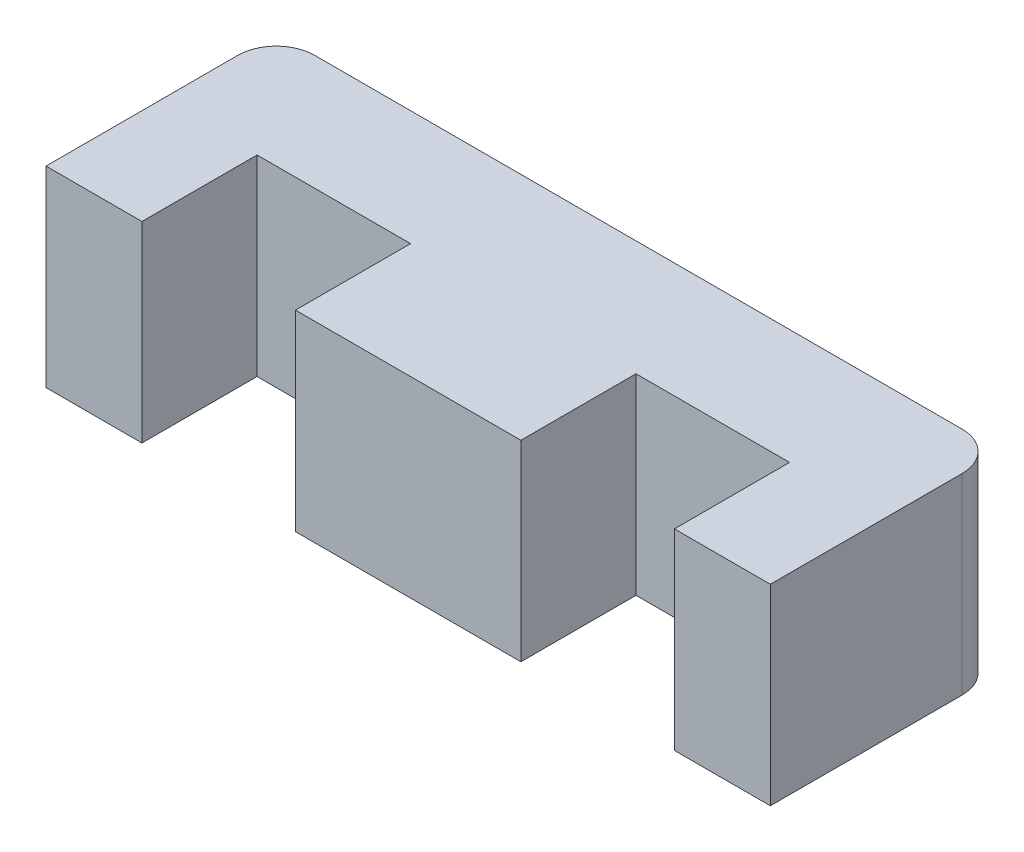
ISO-10303-21;
HEADER;
FILE_DESCRIPTION(('STEP AP214'),'2;1');
FILE_NAME('part.step','',(''),(''),'','','');
FILE_SCHEMA(('AUTOMOTIVE_DESIGN { 1 0 10303 214 1 1 1 1 }'));
ENDSEC;
DATA;
#1=APPLICATION_CONTEXT('core data for automotive mechanical design processes');
#2=APPLICATION_PROTOCOL_DEFINITION('international standard','automotive_design',2000,#1);
#3=PRODUCT_CONTEXT('',#1,'mechanical');
#4=PRODUCT('Part','Part','',(#3));
#5=PRODUCT_RELATED_PRODUCT_CATEGORY('part','',(#4));
#6=PRODUCT_DEFINITION_FORMATION('','',#4);
#7=PRODUCT_DEFINITION_CONTEXT('part definition',#1,'design');
#8=PRODUCT_DEFINITION('design','',#6,#7);
#9=PRODUCT_DEFINITION_SHAPE('','',#8);
#10=(LENGTH_UNIT() NAMED_UNIT(*) SI_UNIT(.MILLI.,.METRE.));
#11=(NAMED_UNIT(*) PLANE_ANGLE_UNIT() SI_UNIT($,.RADIAN.));
#12=(NAMED_UNIT(*) SI_UNIT($,.STERADIAN.) SOLID_ANGLE_UNIT());
#13=UNCERTAINTY_MEASURE_WITH_UNIT(LENGTH_MEASURE(1.E-05),#10,'distance_accuracy_value','');
#14=(GEOMETRIC_REPRESENTATION_CONTEXT(3) GLOBAL_UNCERTAINTY_ASSIGNED_CONTEXT((#13)) GLOBAL_UNIT_ASSIGNED_CONTEXT((#10,
#11,#12)) REPRESENTATION_CONTEXT('',''));
#15=CARTESIAN_POINT('',(0.,0.,0.));
#16=DIRECTION('',(0.,0.,1.));
#17=DIRECTION('',(1.,0.,0.));
#18=AXIS2_PLACEMENT_3D('',#15,#16,#17);
#19=CARTESIAN_POINT('',(0.,10.,6.));
#20=DIRECTION('',(-1.,0.,0.));
#21=DIRECTION('',(0.,0.,1.));
#22=AXIS2_PLACEMENT_3D('',#19,#20,#21);
#23=PLANE('',#22);
#24=DIRECTION('',(0.,0.,-1.));
#25=VECTOR('',#24,1.);
#26=CARTESIAN_POINT('',(0.,0.,6.));
#27=LINE('',#26,#25);
#28=CARTESIAN_POINT('',(0.,0.,6.));
#29=VERTEX_POINT('',#28);
#30=CARTESIAN_POINT('',(0.,0.,0.));
#31=VERTEX_POINT('',#30);
#32=EDGE_CURVE('E167',#29,#31,#27,.T.);
#33=ORIENTED_EDGE('',*,*,#32,.T.);
#34=DIRECTION('',(0.,-1.,0.));
#35=VECTOR('',#34,1.);
#36=CARTESIAN_POINT('',(0.,10.,0.));
#37=LINE('',#36,#35);
#38=CARTESIAN_POINT('',(0.,10.,0.));
#39=VERTEX_POINT('',#38);
#40=EDGE_CURVE('E147',#39,#31,#37,.T.);
#41=ORIENTED_EDGE('',*,*,#40,.F.);
#42=DIRECTION('',(0.,0.,-1.));
#43=VECTOR('',#42,1.);
#44=CARTESIAN_POINT('',(0.,10.,6.));
#45=LINE('',#44,#43);
#46=CARTESIAN_POINT('',(0.,10.,6.));
#47=VERTEX_POINT('',#46);
#48=EDGE_CURVE('E154',#47,#39,#45,.T.);
#49=ORIENTED_EDGE('',*,*,#48,.F.);
#50=DIRECTION('',(0.,-1.,0.));
#51=VECTOR('',#50,1.);
#52=CARTESIAN_POINT('',(0.,10.,6.));
#53=LINE('',#52,#51);
#54=EDGE_CURVE('E232',#47,#29,#53,.T.);
#55=ORIENTED_EDGE('',*,*,#54,.T.);
#56=EDGE_LOOP('',(#33,#41,#49,#55));
#57=FACE_BOUND('',#56,.T.);
#58=ADVANCED_FACE('F38',(#57),#23,.F.);
#59=CARTESIAN_POINT('',(0.,10.,0.));
#60=DIRECTION('',(0.,0.,-1.));
#61=DIRECTION('',(-1.,0.,0.));
#62=AXIS2_PLACEMENT_3D('',#59,#60,#61);
#63=PLANE('',#62);
#64=DIRECTION('',(1.,0.,0.));
#65=VECTOR('',#64,1.);
#66=CARTESIAN_POINT('',(0.,0.,0.));
#67=LINE('',#66,#65);
#68=CARTESIAN_POINT('',(8.,0.,0.));
#69=VERTEX_POINT('',#68);
#70=EDGE_CURVE('E278',#31,#69,#67,.T.);
#71=ORIENTED_EDGE('',*,*,#70,.T.);
#72=DIRECTION('',(0.,-1.,0.));
#73=VECTOR('',#72,1.);
#74=CARTESIAN_POINT('',(8.,10.,0.));
#75=LINE('',#74,#73);
#76=CARTESIAN_POINT('',(8.,10.,0.));
#77=VERTEX_POINT('',#76);
#78=EDGE_CURVE('E150',#77,#69,#75,.T.);
#79=ORIENTED_EDGE('',*,*,#78,.F.);
#80=DIRECTION('',(1.,0.,0.));
#81=VECTOR('',#80,1.);
#82=CARTESIAN_POINT('',(0.,10.,0.));
#83=LINE('',#82,#81);
#84=EDGE_CURVE('E143',#39,#77,#83,.T.);
#85=ORIENTED_EDGE('',*,*,#84,.F.);
#86=ORIENTED_EDGE('',*,*,#40,.T.);
#87=EDGE_LOOP('',(#71,#79,#85,#86));
#88=FACE_BOUND('',#87,.T.);
#89=ADVANCED_FACE('F145',(#88),#63,.F.);
#90=CARTESIAN_POINT('',(8.,10.,0.));
#91=DIRECTION('',(1.,0.,0.));
#92=DIRECTION('',(0.,0.,-1.));
#93=AXIS2_PLACEMENT_3D('',#90,#91,#92);
#94=PLANE('',#93);
#95=DIRECTION('',(0.,0.,1.));
#96=VECTOR('',#95,1.);
#97=CARTESIAN_POINT('',(8.,0.,0.));
#98=LINE('',#97,#96);
#99=CARTESIAN_POINT('',(8.,0.,6.));
#100=VERTEX_POINT('',#99);
#101=EDGE_CURVE('E269',#69,#100,#98,.T.);
#102=ORIENTED_EDGE('',*,*,#101,.T.);
#103=DIRECTION('',(0.,-1.,0.));
#104=VECTOR('',#103,1.);
#105=CARTESIAN_POINT('',(8.,10.,6.));
#106=LINE('',#105,#104);
#107=CARTESIAN_POINT('',(8.,10.,6.));
#108=VERTEX_POINT('',#107);
#109=EDGE_CURVE('E175',#108,#100,#106,.T.);
#110=ORIENTED_EDGE('',*,*,#109,.F.);
#111=DIRECTION('',(0.,0.,1.));
#112=VECTOR('',#111,1.);
#113=CARTESIAN_POINT('',(8.,10.,0.));
#114=LINE('',#113,#112);
#115=EDGE_CURVE('E153',#77,#108,#114,.T.);
#116=ORIENTED_EDGE('',*,*,#115,.F.);
#117=ORIENTED_EDGE('',*,*,#78,.T.);
#118=EDGE_LOOP('',(#102,#110,#116,#117));
#119=FACE_BOUND('',#118,.T.);
#120=ADVANCED_FACE('F310',(#119),#94,.F.);
#121=CARTESIAN_POINT('',(8.,10.,6.));
#122=DIRECTION('',(0.,0.,-1.));
#123=DIRECTION('',(-1.,0.,0.));
#124=AXIS2_PLACEMENT_3D('',#121,#122,#123);
#125=PLANE('',#124);
#126=DIRECTION('',(1.,0.,0.));
#127=VECTOR('',#126,1.);
#128=CARTESIAN_POINT('',(8.,0.,6.));
#129=LINE('',#128,#127);
#130=CARTESIAN_POINT('',(19.75,0.,6.));
#131=VERTEX_POINT('',#130);
#132=EDGE_CURVE('E264',#100,#131,#129,.T.);
#133=ORIENTED_EDGE('',*,*,#132,.T.);
#134=DIRECTION('',(0.,-1.,0.));
#135=VECTOR('',#134,1.);
#136=CARTESIAN_POINT('',(19.75,10.,6.));
#137=LINE('',#136,#135);
#138=CARTESIAN_POINT('',(19.75,10.,6.));
#139=VERTEX_POINT('',#138);
#140=EDGE_CURVE('E253',#139,#131,#137,.T.);
#141=ORIENTED_EDGE('',*,*,#140,.F.);
#142=DIRECTION('',(1.,0.,0.));
#143=VECTOR('',#142,1.);
#144=CARTESIAN_POINT('',(8.,10.,6.));
#145=LINE('',#144,#143);
#146=EDGE_CURVE('E265',#108,#139,#145,.T.);
#147=ORIENTED_EDGE('',*,*,#146,.F.);
#148=ORIENTED_EDGE('',*,*,#109,.T.);
#149=EDGE_LOOP('',(#133,#141,#147,#148));
#150=FACE_BOUND('',#149,.T.);
#151=ADVANCED_FACE('F262',(#150),#125,.F.);
#152=CARTESIAN_POINT('',(19.75,10.,6.));
#153=DIRECTION('',(-1.,0.,0.));
#154=DIRECTION('',(0.,0.,1.));
#155=AXIS2_PLACEMENT_3D('',#152,#153,#154);
#156=PLANE('',#155);
#157=DIRECTION('',(0.,0.,-1.));
#158=VECTOR('',#157,1.);
#159=CARTESIAN_POINT('',(19.75,0.,6.));
#160=LINE('',#159,#158);
#161=CARTESIAN_POINT('',(19.75,0.,0.));
#162=VERTEX_POINT('',#161);
#163=EDGE_CURVE('E271',#131,#162,#160,.T.);
#164=ORIENTED_EDGE('',*,*,#163,.T.);
#165=DIRECTION('',(0.,-1.,0.));
#166=VECTOR('',#165,1.);
#167=CARTESIAN_POINT('',(19.75,10.,0.));
#168=LINE('',#167,#166);
#169=CARTESIAN_POINT('',(19.75,10.,0.));
#170=VERTEX_POINT('',#169);
#171=EDGE_CURVE('E249',#170,#162,#168,.T.);
#172=ORIENTED_EDGE('',*,*,#171,.F.);
#173=DIRECTION('',(0.,0.,-1.));
#174=VECTOR('',#173,1.);
#175=CARTESIAN_POINT('',(19.75,10.,6.));
#176=LINE('',#175,#174);
#177=EDGE_CURVE('E314',#139,#170,#176,.T.);
#178=ORIENTED_EDGE('',*,*,#177,.F.);
#179=ORIENTED_EDGE('',*,*,#140,.T.);
#180=EDGE_LOOP('',(#164,#172,#178,#179));
#181=FACE_BOUND('',#180,.T.);
#182=ADVANCED_FACE('F325',(#181),#156,.F.);
#183=CARTESIAN_POINT('',(19.75,10.,0.));
#184=DIRECTION('',(0.,0.,-1.));
#185=DIRECTION('',(-1.,0.,0.));
#186=AXIS2_PLACEMENT_3D('',#183,#184,#185);
#187=PLANE('',#186);
#188=DIRECTION('',(1.,0.,0.));
#189=VECTOR('',#188,1.);
#190=CARTESIAN_POINT('',(19.75,0.,0.));
#191=LINE('',#190,#189);
#192=CARTESIAN_POINT('',(27.75,0.,0.));
#193=VERTEX_POINT('',#192);
#194=EDGE_CURVE('E276',#162,#193,#191,.T.);
#195=ORIENTED_EDGE('',*,*,#194,.T.);
#196=DIRECTION('',(0.,-1.,0.));
#197=VECTOR('',#196,1.);
#198=CARTESIAN_POINT('',(27.75,10.,0.));
#199=LINE('',#198,#197);
#200=CARTESIAN_POINT('',(27.75,10.,0.));
#201=VERTEX_POINT('',#200);
#202=EDGE_CURVE('E245',#201,#193,#199,.T.);
#203=ORIENTED_EDGE('',*,*,#202,.F.);
#204=DIRECTION('',(1.,0.,0.));
#205=VECTOR('',#204,1.);
#206=CARTESIAN_POINT('',(19.75,10.,0.));
#207=LINE('',#206,#205);
#208=EDGE_CURVE('E300',#170,#201,#207,.T.);
#209=ORIENTED_EDGE('',*,*,#208,.F.);
#210=ORIENTED_EDGE('',*,*,#171,.T.);
#211=EDGE_LOOP('',(#195,#203,#209,#210));
#212=FACE_BOUND('',#211,.T.);
#213=ADVANCED_FACE('F323',(#212),#187,.F.);
#214=CARTESIAN_POINT('',(27.75,10.,0.));
#215=DIRECTION('',(1.,0.,0.));
#216=DIRECTION('',(0.,0.,-1.));
#217=AXIS2_PLACEMENT_3D('',#214,#215,#216);
#218=PLANE('',#217);
#219=DIRECTION('',(0.,0.,1.));
#220=VECTOR('',#219,1.);
#221=CARTESIAN_POINT('',(27.75,0.,0.));
#222=LINE('',#221,#220);
#223=CARTESIAN_POINT('',(27.75,0.,6.));
#224=VERTEX_POINT('',#223);
#225=EDGE_CURVE('E224',#193,#224,#222,.T.);
#226=ORIENTED_EDGE('',*,*,#225,.T.);
#227=DIRECTION('',(0.,-1.,0.));
#228=VECTOR('',#227,1.);
#229=CARTESIAN_POINT('',(27.75,10.,6.));
#230=LINE('',#229,#228);
#231=CARTESIAN_POINT('',(27.75,10.,6.));
#232=VERTEX_POINT('',#231);
#233=EDGE_CURVE('E241',#232,#224,#230,.T.);
#234=ORIENTED_EDGE('',*,*,#233,.F.);
#235=DIRECTION('',(0.,0.,1.));
#236=VECTOR('',#235,1.);
#237=CARTESIAN_POINT('',(27.75,10.,0.));
#238=LINE('',#237,#236);
#239=EDGE_CURVE('E295',#201,#232,#238,.T.);
#240=ORIENTED_EDGE('',*,*,#239,.F.);
#241=ORIENTED_EDGE('',*,*,#202,.T.);
#242=EDGE_LOOP('',(#226,#234,#240,#241));
#243=FACE_BOUND('',#242,.T.);
#244=ADVANCED_FACE('F287',(#243),#218,.F.);
#245=CARTESIAN_POINT('',(27.75,10.,6.));
#246=DIRECTION('',(0.,0.,-1.));
#247=DIRECTION('',(-1.,0.,0.));
#248=AXIS2_PLACEMENT_3D('',#245,#246,#247);
#249=PLANE('',#248);
#250=DIRECTION('',(1.,0.,0.));
#251=VECTOR('',#250,1.);
#252=CARTESIAN_POINT('',(27.75,0.,6.));
#253=LINE('',#252,#251);
#254=CARTESIAN_POINT('',(32.75,0.,6.));
#255=VERTEX_POINT('',#254);
#256=EDGE_CURVE('E218',#224,#255,#253,.T.);
#257=ORIENTED_EDGE('',*,*,#256,.T.);
#258=DIRECTION('',(0.,-1.,0.));
#259=VECTOR('',#258,1.);
#260=CARTESIAN_POINT('',(32.75,10.,6.));
#261=LINE('',#260,#259);
#262=CARTESIAN_POINT('',(32.75,10.,6.));
#263=VERTEX_POINT('',#262);
#264=EDGE_CURVE('E216',#263,#255,#261,.T.);
#265=ORIENTED_EDGE('',*,*,#264,.F.);
#266=DIRECTION('',(1.,0.,0.));
#267=VECTOR('',#266,1.);
#268=CARTESIAN_POINT('',(27.75,10.,6.));
#269=LINE('',#268,#267);
#270=EDGE_CURVE('E293',#232,#263,#269,.T.);
#271=ORIENTED_EDGE('',*,*,#270,.F.);
#272=ORIENTED_EDGE('',*,*,#233,.T.);
#273=EDGE_LOOP('',(#257,#265,#271,#272));
#274=FACE_BOUND('',#273,.T.);
#275=ADVANCED_FACE('F292',(#274),#249,.F.);
#276=CARTESIAN_POINT('',(32.75,10.,6.));
#277=DIRECTION('',(-1.,0.,0.));
#278=DIRECTION('',(0.,0.,1.));
#279=AXIS2_PLACEMENT_3D('',#276,#277,#278);
#280=PLANE('',#279);
#281=DIRECTION('',(0.,0.,-1.));
#282=VECTOR('',#281,1.);
#283=CARTESIAN_POINT('',(32.75,0.,6.));
#284=LINE('',#283,#282);
#285=CARTESIAN_POINT('',(32.75,0.,-4.));
#286=VERTEX_POINT('',#285);
#287=EDGE_CURVE('E211',#255,#286,#284,.T.);
#288=ORIENTED_EDGE('',*,*,#287,.T.);
#289=DIRECTION('',(0.,-1.,0.));
#290=VECTOR('',#289,1.);
#291=CARTESIAN_POINT('',(32.75,10.,-4.));
#292=LINE('',#291,#290);
#293=CARTESIAN_POINT('',(32.75,10.,-4.));
#294=VERTEX_POINT('',#293);
#295=EDGE_CURVE('E62',#286,#294,#292,.F.);
#296=ORIENTED_EDGE('',*,*,#295,.T.);
#297=DIRECTION('',(0.,0.,-1.));
#298=VECTOR('',#297,1.);
#299=CARTESIAN_POINT('',(32.75,10.,6.));
#300=LINE('',#299,#298);
#301=EDGE_CURVE('E195',#263,#294,#300,.T.);
#302=ORIENTED_EDGE('',*,*,#301,.F.);
#303=ORIENTED_EDGE('',*,*,#264,.T.);
#304=EDGE_LOOP('',(#288,#296,#302,#303));
#305=FACE_BOUND('',#304,.T.);
#306=ADVANCED_FACE('F214',(#305),#280,.F.);
#307=CARTESIAN_POINT('',(32.75,10.,-6.));
#308=DIRECTION('',(0.,0.,1.));
#309=DIRECTION('',(1.,0.,0.));
#310=AXIS2_PLACEMENT_3D('',#307,#308,#309);
#311=PLANE('',#310);
#312=DIRECTION('',(-1.,0.,0.));
#313=VECTOR('',#312,1.);
#314=CARTESIAN_POINT('',(32.75,10.,-6.));
#315=LINE('',#314,#313);
#316=CARTESIAN_POINT('',(30.75,10.,-6.));
#317=VERTEX_POINT('',#316);
#318=CARTESIAN_POINT('',(-3.,10.,-6.));
#319=VERTEX_POINT('',#318);
#320=EDGE_CURVE('E194',#317,#319,#315,.T.);
#321=ORIENTED_EDGE('',*,*,#320,.F.);
#322=DIRECTION('',(0.,-1.,0.));
#323=VECTOR('',#322,1.);
#324=CARTESIAN_POINT('',(30.75,10.,-6.));
#325=LINE('',#324,#323);
#326=CARTESIAN_POINT('',(30.75,0.,-6.));
#327=VERTEX_POINT('',#326);
#328=EDGE_CURVE('E173',#317,#327,#325,.T.);
#329=ORIENTED_EDGE('',*,*,#328,.T.);
#330=DIRECTION('',(-1.,0.,0.));
#331=VECTOR('',#330,1.);
#332=CARTESIAN_POINT('',(32.75,0.,-6.));
#333=LINE('',#332,#331);
#334=CARTESIAN_POINT('',(-3.,0.,-6.));
#335=VERTEX_POINT('',#334);
#336=EDGE_CURVE('E212',#327,#335,#333,.T.);
#337=ORIENTED_EDGE('',*,*,#336,.T.);
#338=DIRECTION('',(0.,-1.,0.));
#339=VECTOR('',#338,1.);
#340=CARTESIAN_POINT('',(-3.,10.,-6.));
#341=LINE('',#340,#339);
#342=EDGE_CURVE('E169',#335,#319,#341,.F.);
#343=ORIENTED_EDGE('',*,*,#342,.T.);
#344=EDGE_LOOP('',(#321,#329,#337,#343));
#345=FACE_BOUND('',#344,.T.);
#346=ADVANCED_FACE('F199',(#345),#311,.F.);
#347=CARTESIAN_POINT('',(-5.,10.,-6.));
#348=DIRECTION('',(1.,0.,0.));
#349=DIRECTION('',(0.,0.,-1.));
#350=AXIS2_PLACEMENT_3D('',#347,#348,#349);
#351=PLANE('',#350);
#352=DIRECTION('',(0.,0.,1.));
#353=VECTOR('',#352,1.);
#354=CARTESIAN_POINT('',(-5.,10.,-6.));
#355=LINE('',#354,#353);
#356=CARTESIAN_POINT('',(-5.,10.,-4.));
#357=VERTEX_POINT('',#356);
#358=CARTESIAN_POINT('',(-5.,10.,6.));
#359=VERTEX_POINT('',#358);
#360=EDGE_CURVE('E204',#357,#359,#355,.T.);
#361=ORIENTED_EDGE('',*,*,#360,.F.);
#362=DIRECTION('',(0.,-1.,0.));
#363=VECTOR('',#362,1.);
#364=CARTESIAN_POINT('',(-5.,10.,-4.));
#365=LINE('',#364,#363);
#366=CARTESIAN_POINT('',(-5.,0.,-4.));
#367=VERTEX_POINT('',#366);
#368=EDGE_CURVE('E11',#357,#367,#365,.T.);
#369=ORIENTED_EDGE('',*,*,#368,.T.);
#370=DIRECTION('',(0.,0.,1.));
#371=VECTOR('',#370,1.);
#372=CARTESIAN_POINT('',(-5.,0.,-6.));
#373=LINE('',#372,#371);
#374=CARTESIAN_POINT('',(-5.,0.,6.));
#375=VERTEX_POINT('',#374);
#376=EDGE_CURVE('E222',#367,#375,#373,.T.);
#377=ORIENTED_EDGE('',*,*,#376,.T.);
#378=DIRECTION('',(0.,-1.,0.));
#379=VECTOR('',#378,1.);
#380=CARTESIAN_POINT('',(-5.,10.,6.));
#381=LINE('',#380,#379);
#382=EDGE_CURVE('E235',#359,#375,#381,.T.);
#383=ORIENTED_EDGE('',*,*,#382,.F.);
#384=EDGE_LOOP('',(#361,#369,#377,#383));
#385=FACE_BOUND('',#384,.T.);
#386=ADVANCED_FACE('F356',(#385),#351,.F.);
#387=CARTESIAN_POINT('',(-5.,10.,6.));
#388=DIRECTION('',(0.,0.,-1.));
#389=DIRECTION('',(-1.,0.,0.));
#390=AXIS2_PLACEMENT_3D('',#387,#388,#389);
#391=PLANE('',#390);
#392=DIRECTION('',(1.,0.,0.));
#393=VECTOR('',#392,1.);
#394=CARTESIAN_POINT('',(-5.,0.,6.));
#395=LINE('',#394,#393);
#396=EDGE_CURVE('E164',#375,#29,#395,.T.);
#397=ORIENTED_EDGE('',*,*,#396,.T.);
#398=ORIENTED_EDGE('',*,*,#54,.F.);
#399=DIRECTION('',(1.,0.,0.));
#400=VECTOR('',#399,1.);
#401=CARTESIAN_POINT('',(-5.,10.,6.));
#402=LINE('',#401,#400);
#403=EDGE_CURVE('E159',#359,#47,#402,.T.);
#404=ORIENTED_EDGE('',*,*,#403,.F.);
#405=ORIENTED_EDGE('',*,*,#382,.T.);
#406=EDGE_LOOP('',(#397,#398,#404,#405));
#407=FACE_BOUND('',#406,.T.);
#408=ADVANCED_FACE('F351',(#407),#391,.F.);
#409=CARTESIAN_POINT('',(0.,10.,0.));
#410=DIRECTION('',(0.,-1.,0.));
#411=DIRECTION('',(0.,0.,-1.));
#412=AXIS2_PLACEMENT_3D('',#409,#410,#411);
#413=PLANE('',#412);
#414=ORIENTED_EDGE('',*,*,#301,.T.);
#415=CARTESIAN_POINT('',(30.75,10.,-4.));
#416=DIRECTION('',(0.,-1.,0.));
#417=DIRECTION('',(0.,0.,-1.));
#418=AXIS2_PLACEMENT_3D('',#415,#416,#417);
#419=CIRCLE('',#418,2.);
#420=EDGE_CURVE('E47',#294,#317,#419,.F.);
#421=ORIENTED_EDGE('',*,*,#420,.T.);
#422=ORIENTED_EDGE('',*,*,#320,.T.);
#423=CARTESIAN_POINT('',(-3.,10.,-4.));
#424=DIRECTION('',(0.,-1.,0.));
#425=DIRECTION('',(0.,0.,-1.));
#426=AXIS2_PLACEMENT_3D('',#423,#424,#425);
#427=CIRCLE('',#426,2.);
#428=EDGE_CURVE('E54',#319,#357,#427,.F.);
#429=ORIENTED_EDGE('',*,*,#428,.T.);
#430=ORIENTED_EDGE('',*,*,#360,.T.);
#431=ORIENTED_EDGE('',*,*,#403,.T.);
#432=ORIENTED_EDGE('',*,*,#48,.T.);
#433=ORIENTED_EDGE('',*,*,#84,.T.);
#434=ORIENTED_EDGE('',*,*,#115,.T.);
#435=ORIENTED_EDGE('',*,*,#146,.T.);
#436=ORIENTED_EDGE('',*,*,#177,.T.);
#437=ORIENTED_EDGE('',*,*,#208,.T.);
#438=ORIENTED_EDGE('',*,*,#239,.T.);
#439=ORIENTED_EDGE('',*,*,#270,.T.);
#440=EDGE_LOOP('',(#414,#421,#422,#429,#430,#431,#432,#433,#434,#435,#436,#437,#438,#439));
#441=FACE_BOUND('',#440,.T.);
#442=ADVANCED_FACE('F157',(#441),#413,.F.);
#443=CARTESIAN_POINT('',(0.,0.,0.));
#444=DIRECTION('',(0.,-1.,0.));
#445=DIRECTION('',(0.,0.,-1.));
#446=AXIS2_PLACEMENT_3D('',#443,#444,#445);
#447=PLANE('',#446);
#448=ORIENTED_EDGE('',*,*,#336,.F.);
#449=CARTESIAN_POINT('',(30.75,0.,-4.));
#450=DIRECTION('',(0.,-1.,0.));
#451=DIRECTION('',(0.,0.,-1.));
#452=AXIS2_PLACEMENT_3D('',#449,#450,#451);
#453=CIRCLE('',#452,2.);
#454=EDGE_CURVE('E185',#327,#286,#453,.T.);
#455=ORIENTED_EDGE('',*,*,#454,.T.);
#456=ORIENTED_EDGE('',*,*,#287,.F.);
#457=ORIENTED_EDGE('',*,*,#256,.F.);
#458=ORIENTED_EDGE('',*,*,#225,.F.);
#459=ORIENTED_EDGE('',*,*,#194,.F.);
#460=ORIENTED_EDGE('',*,*,#163,.F.);
#461=ORIENTED_EDGE('',*,*,#132,.F.);
#462=ORIENTED_EDGE('',*,*,#101,.F.);
#463=ORIENTED_EDGE('',*,*,#70,.F.);
#464=ORIENTED_EDGE('',*,*,#32,.F.);
#465=ORIENTED_EDGE('',*,*,#396,.F.);
#466=ORIENTED_EDGE('',*,*,#376,.F.);
#467=CARTESIAN_POINT('',(-3.,0.,-4.));
#468=DIRECTION('',(0.,-1.,0.));
#469=DIRECTION('',(0.,0.,-1.));
#470=AXIS2_PLACEMENT_3D('',#467,#468,#469);
#471=CIRCLE('',#470,2.);
#472=EDGE_CURVE('E182',#367,#335,#471,.T.);
#473=ORIENTED_EDGE('',*,*,#472,.T.);
#474=EDGE_LOOP('',(#448,#455,#456,#457,#458,#459,#460,#461,#462,#463,#464,#465,#466,#473));
#475=FACE_BOUND('',#474,.T.);
#476=ADVANCED_FACE('F209',(#475),#447,.T.);
#477=CARTESIAN_POINT('',(30.75,10.,-4.));
#478=DIRECTION('',(0.,-1.,0.));
#479=DIRECTION('',(0.,0.,-1.));
#480=AXIS2_PLACEMENT_3D('',#477,#478,#479);
#481=CYLINDRICAL_SURFACE('',#480,2.);
#482=ORIENTED_EDGE('',*,*,#420,.F.);
#483=ORIENTED_EDGE('',*,*,#295,.F.);
#484=ORIENTED_EDGE('',*,*,#454,.F.);
#485=ORIENTED_EDGE('',*,*,#328,.F.);
#486=EDGE_LOOP('',(#482,#483,#484,#485));
#487=FACE_BOUND('',#486,.T.);
#488=ADVANCED_FACE('F206',(#487),#481,.T.);
#489=CARTESIAN_POINT('',(-3.,10.,-4.));
#490=DIRECTION('',(0.,-1.,0.));
#491=DIRECTION('',(0.,0.,-1.));
#492=AXIS2_PLACEMENT_3D('',#489,#490,#491);
#493=CYLINDRICAL_SURFACE('',#492,2.);
#494=ORIENTED_EDGE('',*,*,#428,.F.);
#495=ORIENTED_EDGE('',*,*,#342,.F.);
#496=ORIENTED_EDGE('',*,*,#472,.F.);
#497=ORIENTED_EDGE('',*,*,#368,.F.);
#498=EDGE_LOOP('',(#494,#495,#496,#497));
#499=FACE_BOUND('',#498,.T.);
#500=ADVANCED_FACE('F40',(#499),#493,.T.);
#501=CLOSED_SHELL('',(#58,#89,#120,#151,#182,#213,#244,#275,#306,#346,#386,#408,#442,#476,#488,#500));
#502=MANIFOLD_SOLID_BREP('B2',#501);
#503=ADVANCED_BREP_SHAPE_REPRESENTATION('',(#18,#502),#14);
#504=SHAPE_DEFINITION_REPRESENTATION(#9,#503);
ENDSEC;
END-ISO-10303-21;
